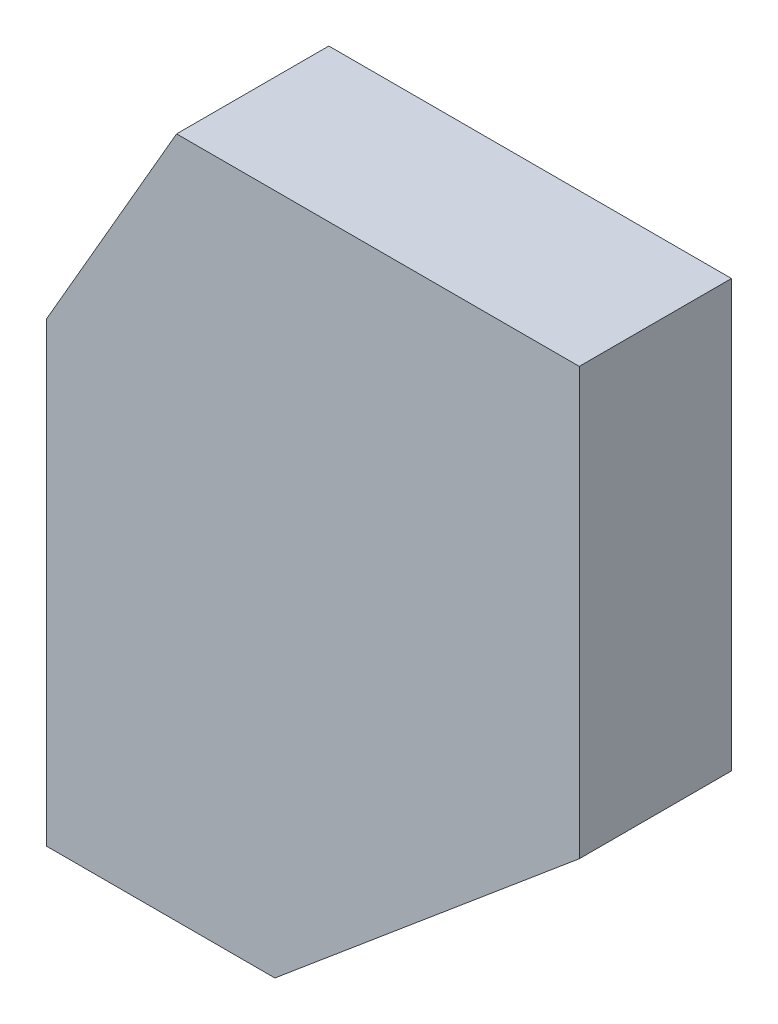
ISO-10303-21;
HEADER;
FILE_DESCRIPTION(('STEP AP214'),'2;1');
FILE_NAME('part.step','',(''),(''),'','','');
FILE_SCHEMA(('AUTOMOTIVE_DESIGN { 1 0 10303 214 1 1 1 1 }'));
ENDSEC;
DATA;
#1=APPLICATION_CONTEXT('core data for automotive mechanical design processes');
#2=APPLICATION_PROTOCOL_DEFINITION('international standard','automotive_design',2000,#1);
#3=PRODUCT_CONTEXT('',#1,'mechanical');
#4=PRODUCT('Part','Part','',(#3));
#5=PRODUCT_RELATED_PRODUCT_CATEGORY('part','',(#4));
#6=PRODUCT_DEFINITION_FORMATION('','',#4);
#7=PRODUCT_DEFINITION_CONTEXT('part definition',#1,'design');
#8=PRODUCT_DEFINITION('design','',#6,#7);
#9=PRODUCT_DEFINITION_SHAPE('','',#8);
#10=(LENGTH_UNIT() NAMED_UNIT(*) SI_UNIT(.MILLI.,.METRE.));
#11=(NAMED_UNIT(*) PLANE_ANGLE_UNIT() SI_UNIT($,.RADIAN.));
#12=(NAMED_UNIT(*) SI_UNIT($,.STERADIAN.) SOLID_ANGLE_UNIT());
#13=UNCERTAINTY_MEASURE_WITH_UNIT(LENGTH_MEASURE(1.E-05),#10,'distance_accuracy_value','');
#14=(GEOMETRIC_REPRESENTATION_CONTEXT(3) GLOBAL_UNCERTAINTY_ASSIGNED_CONTEXT((#13)) GLOBAL_UNIT_ASSIGNED_CONTEXT((#10,
#11,#12)) REPRESENTATION_CONTEXT('',''));
#15=CARTESIAN_POINT('',(0.,0.,0.));
#16=DIRECTION('',(0.,0.,1.));
#17=DIRECTION('',(1.,0.,0.));
#18=AXIS2_PLACEMENT_3D('',#15,#16,#17);
#19=CARTESIAN_POINT('',(0.,38.1,12.7));
#20=DIRECTION('',(1.,0.,0.));
#21=DIRECTION('',(0.,0.,-1.));
#22=AXIS2_PLACEMENT_3D('',#19,#20,#21);
#23=PLANE('',#22);
#24=DIRECTION('',(0.,-1.,0.));
#25=VECTOR('',#24,1.);
#26=CARTESIAN_POINT('',(0.,38.1,0.));
#27=LINE('',#26,#25);
#28=CARTESIAN_POINT('',(0.,38.1,0.));
#29=VERTEX_POINT('',#28);
#30=CARTESIAN_POINT('',(0.,0.,0.));
#31=VERTEX_POINT('',#30);
#32=EDGE_CURVE('E121',#29,#31,#27,.T.);
#33=ORIENTED_EDGE('',*,*,#32,.T.);
#34=DIRECTION('',(0.,0.,-1.));
#35=VECTOR('',#34,1.);
#36=CARTESIAN_POINT('',(0.,0.,12.7));
#37=LINE('',#36,#35);
#38=CARTESIAN_POINT('',(0.,0.,12.7));
#39=VERTEX_POINT('',#38);
#40=EDGE_CURVE('E11',#39,#31,#37,.T.);
#41=ORIENTED_EDGE('',*,*,#40,.F.);
#42=DIRECTION('',(0.,-1.,0.));
#43=VECTOR('',#42,1.);
#44=CARTESIAN_POINT('',(0.,38.1,12.7));
#45=LINE('',#44,#43);
#46=CARTESIAN_POINT('',(0.,38.1,12.7));
#47=VERTEX_POINT('',#46);
#48=EDGE_CURVE('E131',#47,#39,#45,.T.);
#49=ORIENTED_EDGE('',*,*,#48,.F.);
#50=DIRECTION('',(0.,0.,-1.));
#51=VECTOR('',#50,1.);
#52=CARTESIAN_POINT('',(0.,38.1,12.7));
#53=LINE('',#52,#51);
#54=EDGE_CURVE('E117',#47,#29,#53,.T.);
#55=ORIENTED_EDGE('',*,*,#54,.T.);
#56=EDGE_LOOP('',(#33,#41,#49,#55));
#57=FACE_BOUND('',#56,.T.);
#58=ADVANCED_FACE('F37',(#57),#23,.F.);
#59=CARTESIAN_POINT('',(0.,0.,12.7));
#60=DIRECTION('',(0.,1.,0.));
#61=DIRECTION('',(0.,0.,1.));
#62=AXIS2_PLACEMENT_3D('',#59,#60,#61);
#63=PLANE('',#62);
#64=DIRECTION('',(1.,0.,0.));
#65=VECTOR('',#64,1.);
#66=CARTESIAN_POINT('',(0.,0.,0.));
#67=LINE('',#66,#65);
#68=CARTESIAN_POINT('',(19.05,0.,0.));
#69=VERTEX_POINT('',#68);
#70=EDGE_CURVE('E124',#31,#69,#67,.T.);
#71=ORIENTED_EDGE('',*,*,#70,.T.);
#72=DIRECTION('',(0.,0.,-1.));
#73=VECTOR('',#72,1.);
#74=CARTESIAN_POINT('',(19.05,0.,12.7));
#75=LINE('',#74,#73);
#76=CARTESIAN_POINT('',(19.05,0.,12.7));
#77=VERTEX_POINT('',#76);
#78=EDGE_CURVE('E45',#77,#69,#75,.T.);
#79=ORIENTED_EDGE('',*,*,#78,.F.);
#80=DIRECTION('',(1.,0.,0.));
#81=VECTOR('',#80,1.);
#82=CARTESIAN_POINT('',(0.,0.,12.7));
#83=LINE('',#82,#81);
#84=EDGE_CURVE('E90',#39,#77,#83,.T.);
#85=ORIENTED_EDGE('',*,*,#84,.F.);
#86=ORIENTED_EDGE('',*,*,#40,.T.);
#87=EDGE_LOOP('',(#71,#79,#85,#86));
#88=FACE_BOUND('',#87,.T.);
#89=ADVANCED_FACE('F155',(#88),#63,.F.);
#90=CARTESIAN_POINT('',(19.05,0.,12.7));
#91=DIRECTION('',(-0.642787609686541,0.766044443118977,0.));
#92=DIRECTION('',(-0.766044443118977,-0.642787609686541,0.));
#93=AXIS2_PLACEMENT_3D('',#90,#91,#92);
#94=PLANE('',#93);
#95=DIRECTION('',(0.766044443118976,0.642787609686541,0.));
#96=VECTOR('',#95,1.);
#97=CARTESIAN_POINT('',(19.05,0.,0.));
#98=LINE('',#97,#96);
#99=CARTESIAN_POINT('',(44.45,21.313130631903,0.));
#100=VERTEX_POINT('',#99);
#101=EDGE_CURVE('E126',#69,#100,#98,.T.);
#102=ORIENTED_EDGE('',*,*,#101,.T.);
#103=DIRECTION('',(0.,0.,-1.));
#104=VECTOR('',#103,1.);
#105=CARTESIAN_POINT('',(44.45,21.313130631903,12.7));
#106=LINE('',#105,#104);
#107=CARTESIAN_POINT('',(44.45,21.313130631903,12.7));
#108=VERTEX_POINT('',#107);
#109=EDGE_CURVE('E112',#108,#100,#106,.T.);
#110=ORIENTED_EDGE('',*,*,#109,.F.);
#111=DIRECTION('',(0.766044443118976,0.642787609686541,0.));
#112=VECTOR('',#111,1.);
#113=CARTESIAN_POINT('',(19.05,0.,12.7));
#114=LINE('',#113,#112);
#115=EDGE_CURVE('E103',#77,#108,#114,.T.);
#116=ORIENTED_EDGE('',*,*,#115,.F.);
#117=ORIENTED_EDGE('',*,*,#78,.T.);
#118=EDGE_LOOP('',(#102,#110,#116,#117));
#119=FACE_BOUND('',#118,.T.);
#120=ADVANCED_FACE('F137',(#119),#94,.F.);
#121=CARTESIAN_POINT('',(44.45,21.313130631903,12.7));
#122=DIRECTION('',(-1.,0.,0.));
#123=DIRECTION('',(0.,0.,1.));
#124=AXIS2_PLACEMENT_3D('',#121,#122,#123);
#125=PLANE('',#124);
#126=DIRECTION('',(0.,1.,0.));
#127=VECTOR('',#126,1.);
#128=CARTESIAN_POINT('',(44.45,21.313130631903,0.));
#129=LINE('',#128,#127);
#130=CARTESIAN_POINT('',(44.45,56.896,0.));
#131=VERTEX_POINT('',#130);
#132=EDGE_CURVE('E111',#100,#131,#129,.T.);
#133=ORIENTED_EDGE('',*,*,#132,.T.);
#134=DIRECTION('',(0.,0.,-1.));
#135=VECTOR('',#134,1.);
#136=CARTESIAN_POINT('',(44.45,56.896,12.7));
#137=LINE('',#136,#135);
#138=CARTESIAN_POINT('',(44.45,56.896,12.7));
#139=VERTEX_POINT('',#138);
#140=EDGE_CURVE('E108',#139,#131,#137,.T.);
#141=ORIENTED_EDGE('',*,*,#140,.F.);
#142=DIRECTION('',(0.,1.,0.));
#143=VECTOR('',#142,1.);
#144=CARTESIAN_POINT('',(44.45,21.313130631903,12.7));
#145=LINE('',#144,#143);
#146=EDGE_CURVE('E97',#108,#139,#145,.T.);
#147=ORIENTED_EDGE('',*,*,#146,.F.);
#148=ORIENTED_EDGE('',*,*,#109,.T.);
#149=EDGE_LOOP('',(#133,#141,#147,#148));
#150=FACE_BOUND('',#149,.T.);
#151=ADVANCED_FACE('F109',(#150),#125,.F.);
#152=CARTESIAN_POINT('',(44.45,56.896,12.7));
#153=DIRECTION('',(0.,-1.,0.));
#154=DIRECTION('',(1.,0.,0.));
#155=AXIS2_PLACEMENT_3D('',#152,#153,#154);
#156=PLANE('',#155);
#157=DIRECTION('',(-1.,0.,0.));
#158=VECTOR('',#157,1.);
#159=CARTESIAN_POINT('',(44.45,56.896,0.));
#160=LINE('',#159,#158);
#161=CARTESIAN_POINT('',(10.8518756596882,56.896,0.));
#162=VERTEX_POINT('',#161);
#163=EDGE_CURVE('E76',#131,#162,#160,.T.);
#164=ORIENTED_EDGE('',*,*,#163,.T.);
#165=DIRECTION('',(0.,0.,-1.));
#166=VECTOR('',#165,1.);
#167=CARTESIAN_POINT('',(10.8518756596882,56.896,12.7));
#168=LINE('',#167,#166);
#169=CARTESIAN_POINT('',(10.8518756596882,56.896,12.7));
#170=VERTEX_POINT('',#169);
#171=EDGE_CURVE('E113',#170,#162,#168,.T.);
#172=ORIENTED_EDGE('',*,*,#171,.F.);
#173=DIRECTION('',(-1.,0.,0.));
#174=VECTOR('',#173,1.);
#175=CARTESIAN_POINT('',(44.45,56.896,12.7));
#176=LINE('',#175,#174);
#177=EDGE_CURVE('E101',#139,#170,#176,.T.);
#178=ORIENTED_EDGE('',*,*,#177,.F.);
#179=ORIENTED_EDGE('',*,*,#140,.T.);
#180=EDGE_LOOP('',(#164,#172,#178,#179));
#181=FACE_BOUND('',#180,.T.);
#182=ADVANCED_FACE('F115',(#181),#156,.F.);
#183=CARTESIAN_POINT('',(10.8518756596882,56.896,12.7));
#184=DIRECTION('',(0.866025403784438,-0.500000000000001,0.));
#185=DIRECTION('',(0.500000000000001,0.866025403784438,0.));
#186=AXIS2_PLACEMENT_3D('',#183,#184,#185);
#187=PLANE('',#186);
#188=DIRECTION('',(-0.500000000000001,-0.866025403784438,0.));
#189=VECTOR('',#188,1.);
#190=CARTESIAN_POINT('',(10.8518756596882,56.896,0.));
#191=LINE('',#190,#189);
#192=EDGE_CURVE('E82',#162,#29,#191,.T.);
#193=ORIENTED_EDGE('',*,*,#192,.T.);
#194=ORIENTED_EDGE('',*,*,#54,.F.);
#195=DIRECTION('',(-0.500000000000001,-0.866025403784438,0.));
#196=VECTOR('',#195,1.);
#197=CARTESIAN_POINT('',(10.8518756596882,56.896,12.7));
#198=LINE('',#197,#196);
#199=EDGE_CURVE('E53',#170,#47,#198,.T.);
#200=ORIENTED_EDGE('',*,*,#199,.F.);
#201=ORIENTED_EDGE('',*,*,#171,.T.);
#202=EDGE_LOOP('',(#193,#194,#200,#201));
#203=FACE_BOUND('',#202,.T.);
#204=ADVANCED_FACE('F144',(#203),#187,.F.);
#205=CARTESIAN_POINT('',(0.,0.,12.7));
#206=DIRECTION('',(0.,0.,1.));
#207=DIRECTION('',(1.,0.,0.));
#208=AXIS2_PLACEMENT_3D('',#205,#206,#207);
#209=PLANE('',#208);
#210=ORIENTED_EDGE('',*,*,#48,.T.);
#211=ORIENTED_EDGE('',*,*,#84,.T.);
#212=ORIENTED_EDGE('',*,*,#115,.T.);
#213=ORIENTED_EDGE('',*,*,#146,.T.);
#214=ORIENTED_EDGE('',*,*,#177,.T.);
#215=ORIENTED_EDGE('',*,*,#199,.T.);
#216=EDGE_LOOP('',(#210,#211,#212,#213,#214,#215));
#217=FACE_BOUND('',#216,.T.);
#218=ADVANCED_FACE('F99',(#217),#209,.T.);
#219=CARTESIAN_POINT('',(0.,0.,0.));
#220=DIRECTION('',(0.,0.,1.));
#221=DIRECTION('',(1.,0.,0.));
#222=AXIS2_PLACEMENT_3D('',#219,#220,#221);
#223=PLANE('',#222);
#224=ORIENTED_EDGE('',*,*,#32,.F.);
#225=ORIENTED_EDGE('',*,*,#192,.F.);
#226=ORIENTED_EDGE('',*,*,#163,.F.);
#227=ORIENTED_EDGE('',*,*,#132,.F.);
#228=ORIENTED_EDGE('',*,*,#101,.F.);
#229=ORIENTED_EDGE('',*,*,#70,.F.);
#230=EDGE_LOOP('',(#224,#225,#226,#227,#228,#229));
#231=FACE_BOUND('',#230,.T.);
#232=ADVANCED_FACE('F140',(#231),#223,.F.);
#233=CLOSED_SHELL('',(#58,#89,#120,#151,#182,#204,#218,#232));
#234=MANIFOLD_SOLID_BREP('B2',#233);
#235=ADVANCED_BREP_SHAPE_REPRESENTATION('',(#18,#234),#14);
#236=SHAPE_DEFINITION_REPRESENTATION(#9,#235);
ENDSEC;
END-ISO-10303-21;
